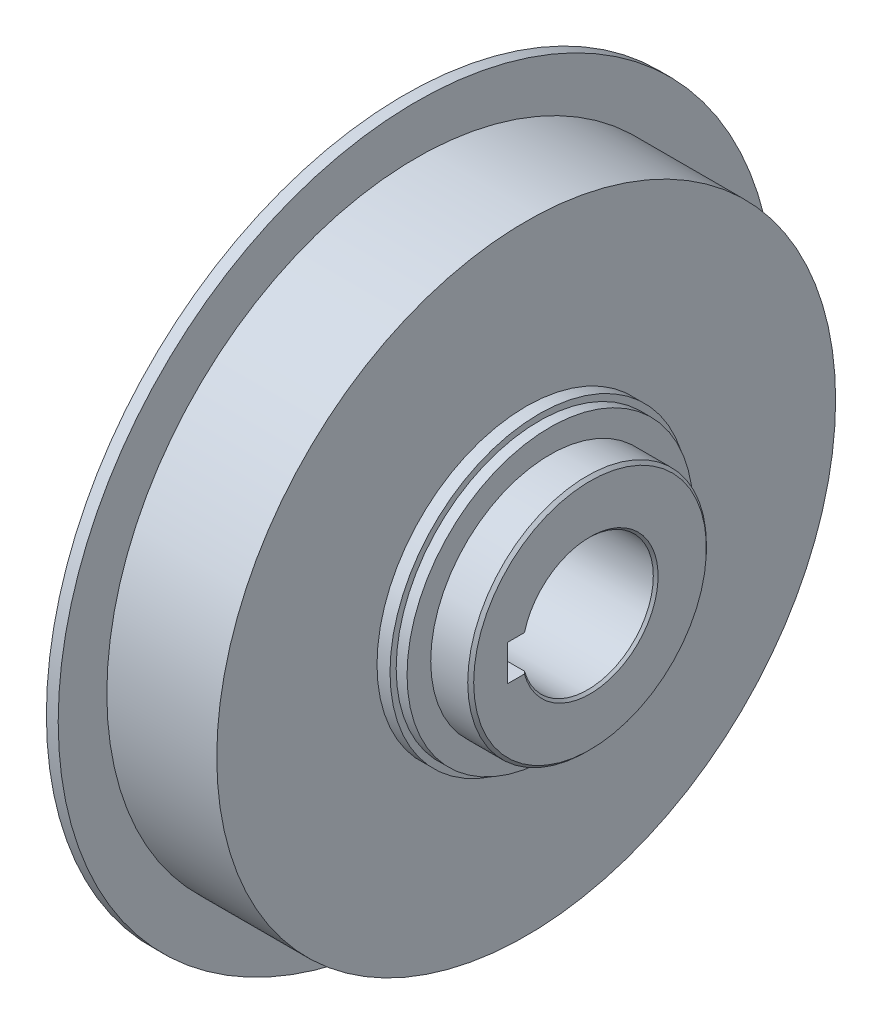
ISO-10303-21;
HEADER;
FILE_DESCRIPTION(('STEP AP214'),'2;1');
FILE_NAME('part.step','',(''),(''),'','','');
FILE_SCHEMA(('AUTOMOTIVE_DESIGN { 1 0 10303 214 1 1 1 1 }'));
ENDSEC;
DATA;
#1=APPLICATION_CONTEXT('core data for automotive mechanical design processes');
#2=APPLICATION_PROTOCOL_DEFINITION('international standard','automotive_design',2000,#1);
#3=PRODUCT_CONTEXT('',#1,'mechanical');
#4=PRODUCT('Part','Part','',(#3));
#5=PRODUCT_RELATED_PRODUCT_CATEGORY('part','',(#4));
#6=PRODUCT_DEFINITION_FORMATION('','',#4);
#7=PRODUCT_DEFINITION_CONTEXT('part definition',#1,'design');
#8=PRODUCT_DEFINITION('design','',#6,#7);
#9=PRODUCT_DEFINITION_SHAPE('','',#8);
#10=(LENGTH_UNIT() NAMED_UNIT(*) SI_UNIT(.MILLI.,.METRE.));
#11=(NAMED_UNIT(*) PLANE_ANGLE_UNIT() SI_UNIT($,.RADIAN.));
#12=(NAMED_UNIT(*) SI_UNIT($,.STERADIAN.) SOLID_ANGLE_UNIT());
#13=UNCERTAINTY_MEASURE_WITH_UNIT(LENGTH_MEASURE(1.E-05),#10,'distance_accuracy_value','');
#14=(GEOMETRIC_REPRESENTATION_CONTEXT(3) GLOBAL_UNCERTAINTY_ASSIGNED_CONTEXT((#13)) GLOBAL_UNIT_ASSIGNED_CONTEXT((#10,
#11,#12)) REPRESENTATION_CONTEXT('',''));
#15=CARTESIAN_POINT('',(0.,0.,0.));
#16=DIRECTION('',(0.,0.,1.));
#17=DIRECTION('',(1.,0.,0.));
#18=AXIS2_PLACEMENT_3D('',#15,#16,#17);
#19=CARTESIAN_POINT('',(75.6,0.,0.));
#20=DIRECTION('',(1.,0.,0.));
#21=DIRECTION('',(0.,0.,-1.));
#22=AXIS2_PLACEMENT_3D('',#19,#20,#21);
#23=CONICAL_SURFACE('',#22,11.4,0.785398163397446);
#24=CARTESIAN_POINT('',(75.2,0.,0.));
#25=DIRECTION('',(-1.,0.,0.));
#26=DIRECTION('',(0.,0.,1.));
#27=AXIS2_PLACEMENT_3D('',#24,#25,#26);
#28=CIRCLE('',#27,11.);
#29=CARTESIAN_POINT('',(75.2,3.,10.5830052442584));
#30=VERTEX_POINT('',#29);
#31=CARTESIAN_POINT('',(75.2,-3.,10.5830052442584));
#32=VERTEX_POINT('',#31);
#33=EDGE_CURVE('E80',#30,#32,#28,.T.);
#34=ORIENTED_EDGE('',*,*,#33,.T.);
#35=CARTESIAN_POINT('',(75.6,-3.,10.998181667894));
#36=CARTESIAN_POINT('',(75.5332855955519,-3.,10.9290315903387));
#37=CARTESIAN_POINT('',(75.4665950600653,-3.,10.8598585163316));
#38=CARTESIAN_POINT('',(75.3332617267318,-3.,10.7214663751199));
#39=CARTESIAN_POINT('',(75.2666189288851,-3.,10.6522473079151));
#40=CARTESIAN_POINT('',(75.2,-3.,10.5830052442584));
#41=B_SPLINE_CURVE_WITH_KNOTS('',3,(#35,#36,#37,#38,#39,#40),.UNSPECIFIED.,.F.,.F.,(4,2,4),(0.,
0.288258348048535,0.576516697322075),.UNSPECIFIED.);
#42=CARTESIAN_POINT('',(75.6,-3.,10.998181667894));
#43=VERTEX_POINT('',#42);
#44=EDGE_CURVE('E75',#43,#32,#41,.T.);
#45=ORIENTED_EDGE('',*,*,#44,.F.);
#46=CARTESIAN_POINT('',(75.6,0.,0.));
#47=DIRECTION('',(1.,0.,0.));
#48=DIRECTION('',(0.,0.,-1.));
#49=AXIS2_PLACEMENT_3D('',#46,#47,#48);
#50=CIRCLE('',#49,11.4);
#51=CARTESIAN_POINT('',(75.6,3.,10.998181667894));
#52=VERTEX_POINT('',#51);
#53=EDGE_CURVE('E73',#52,#43,#50,.F.);
#54=ORIENTED_EDGE('',*,*,#53,.F.);
#55=CARTESIAN_POINT('',(75.2,3.,10.5830052442584));
#56=CARTESIAN_POINT('',(75.2666189288851,3.,10.6522473079151));
#57=CARTESIAN_POINT('',(75.3332617267318,3.,10.7214663751199));
#58=CARTESIAN_POINT('',(75.4665950600653,3.,10.8598585163316));
#59=CARTESIAN_POINT('',(75.5332855955519,3.,10.9290315903387));
#60=CARTESIAN_POINT('',(75.6,3.,10.998181667894));
#61=B_SPLINE_CURVE_WITH_KNOTS('',3,(#55,#56,#57,#58,#59,#60),.UNSPECIFIED.,.F.,.F.,(4,2,4),(0.,
0.288258349273535,0.576516697322084),.UNSPECIFIED.);
#62=EDGE_CURVE('E21',#30,#52,#61,.T.);
#63=ORIENTED_EDGE('',*,*,#62,.F.);
#64=EDGE_LOOP('',(#34,#45,#54,#63));
#65=FACE_BOUND('',#64,.T.);
#66=ADVANCED_FACE('F17',(#65),#23,.F.);
#67=CARTESIAN_POINT('',(56.45,0.,0.));
#68=DIRECTION('',(-1.,0.,0.));
#69=DIRECTION('',(0.,0.,1.));
#70=AXIS2_PLACEMENT_3D('',#67,#68,#69);
#71=CYLINDRICAL_SURFACE('',#70,11.);
#72=ORIENTED_EDGE('',*,*,#33,.F.);
#73=DIRECTION('',(1.,0.,0.));
#74=VECTOR('',#73,1.);
#75=CARTESIAN_POINT('',(56.45,3.,10.5830052442584));
#76=LINE('',#75,#74);
#77=CARTESIAN_POINT('',(37.7,3.,10.5830052442584));
#78=VERTEX_POINT('',#77);
#79=EDGE_CURVE('E88',#78,#30,#76,.T.);
#80=ORIENTED_EDGE('',*,*,#79,.F.);
#81=CARTESIAN_POINT('',(37.7,0.,0.));
#82=DIRECTION('',(-1.,0.,0.));
#83=DIRECTION('',(0.,0.,1.));
#84=AXIS2_PLACEMENT_3D('',#81,#82,#83);
#85=CIRCLE('',#84,11.);
#86=CARTESIAN_POINT('',(37.7,-3.,10.5830052442584));
#87=VERTEX_POINT('',#86);
#88=EDGE_CURVE('E94',#78,#87,#85,.T.);
#89=ORIENTED_EDGE('',*,*,#88,.T.);
#90=DIRECTION('',(1.,0.,0.));
#91=VECTOR('',#90,1.);
#92=CARTESIAN_POINT('',(56.45,-3.,10.5830052442584));
#93=LINE('',#92,#91);
#94=EDGE_CURVE('E79',#32,#87,#93,.F.);
#95=ORIENTED_EDGE('',*,*,#94,.F.);
#96=EDGE_LOOP('',(#72,#80,#89,#95));
#97=FACE_BOUND('',#96,.T.);
#98=ADVANCED_FACE('F309',(#97),#71,.F.);
#99=CARTESIAN_POINT('',(75.6,0.,15.45));
#100=DIRECTION('',(1.,0.,0.));
#101=DIRECTION('',(0.,0.,-1.));
#102=AXIS2_PLACEMENT_3D('',#99,#100,#101);
#103=PLANE('',#102);
#104=DIRECTION('',(0.,0.,-1.));
#105=VECTOR('',#104,1.);
#106=CARTESIAN_POINT('',(75.6,3.,6.9));
#107=LINE('',#106,#105);
#108=CARTESIAN_POINT('',(75.6,3.,13.8));
#109=VERTEX_POINT('',#108);
#110=EDGE_CURVE('E85',#52,#109,#107,.F.);
#111=ORIENTED_EDGE('',*,*,#110,.F.);
#112=ORIENTED_EDGE('',*,*,#53,.T.);
#113=DIRECTION('',(0.,0.,1.));
#114=VECTOR('',#113,1.);
#115=CARTESIAN_POINT('',(75.6,-3.,6.9));
#116=LINE('',#115,#114);
#117=CARTESIAN_POINT('',(75.6,-3.,13.8));
#118=VERTEX_POINT('',#117);
#119=EDGE_CURVE('E110',#118,#43,#116,.F.);
#120=ORIENTED_EDGE('',*,*,#119,.F.);
#121=DIRECTION('',(0.,1.,0.));
#122=VECTOR('',#121,1.);
#123=CARTESIAN_POINT('',(75.6,0.,13.8));
#124=LINE('',#123,#122);
#125=EDGE_CURVE('E92',#118,#109,#124,.T.);
#126=ORIENTED_EDGE('',*,*,#125,.T.);
#127=EDGE_LOOP('',(#111,#112,#120,#126));
#128=FACE_BOUND('',#127,.T.);
#129=CARTESIAN_POINT('',(75.6,0.,0.));
#130=DIRECTION('',(-1.,0.,0.));
#131=DIRECTION('',(0.,0.,1.));
#132=AXIS2_PLACEMENT_3D('',#129,#130,#131);
#133=CIRCLE('',#132,19.5);
#134=CARTESIAN_POINT('',(75.6,0.,19.5));
#135=VERTEX_POINT('',#134);
#136=EDGE_CURVE('E149',#135,#135,#133,.T.);
#137=ORIENTED_EDGE('',*,*,#136,.F.);
#138=EDGE_LOOP('',(#137));
#139=FACE_BOUND('',#138,.T.);
#140=ADVANCED_FACE('F89',(#128,#139),#103,.T.);
#141=CARTESIAN_POINT('',(56.45,-3.,6.9));
#142=DIRECTION('',(0.,1.,0.));
#143=DIRECTION('',(0.,0.,1.));
#144=AXIS2_PLACEMENT_3D('',#141,#142,#143);
#145=PLANE('',#144);
#146=DIRECTION('',(1.,0.,0.));
#147=VECTOR('',#146,1.);
#148=CARTESIAN_POINT('',(56.45,-3.,13.8));
#149=LINE('',#148,#147);
#150=CARTESIAN_POINT('',(37.3,-3.,13.8));
#151=VERTEX_POINT('',#150);
#152=EDGE_CURVE('E386',#151,#118,#149,.T.);
#153=ORIENTED_EDGE('',*,*,#152,.T.);
#154=ORIENTED_EDGE('',*,*,#119,.T.);
#155=ORIENTED_EDGE('',*,*,#44,.T.);
#156=ORIENTED_EDGE('',*,*,#94,.T.);
#157=CARTESIAN_POINT('',(37.7,-3.,10.5830052442584));
#158=CARTESIAN_POINT('',(37.6333810711149,-3.,10.6522473079151));
#159=CARTESIAN_POINT('',(37.5667382732682,-3.,10.7214663751199));
#160=CARTESIAN_POINT('',(37.4334049399347,-3.,10.8598585163316));
#161=CARTESIAN_POINT('',(37.3667144044481,-3.,10.9290315903387));
#162=CARTESIAN_POINT('',(37.3,-3.,10.998181667894));
#163=B_SPLINE_CURVE_WITH_KNOTS('',3,(#157,#158,#159,#160,#161,#162),.UNSPECIFIED.,.F.,.F.,(4,2,
4),(0.,0.288258349273538,0.576516697322079),.UNSPECIFIED.);
#164=CARTESIAN_POINT('',(37.3,-3.,10.998181667894));
#165=VERTEX_POINT('',#164);
#166=EDGE_CURVE('E97',#87,#165,#163,.T.);
#167=ORIENTED_EDGE('',*,*,#166,.T.);
#168=DIRECTION('',(0.,0.,1.));
#169=VECTOR('',#168,1.);
#170=CARTESIAN_POINT('',(37.3,-3.,28.3875));
#171=LINE('',#170,#169);
#172=EDGE_CURVE('E148',#151,#165,#171,.F.);
#173=ORIENTED_EDGE('',*,*,#172,.F.);
#174=EDGE_LOOP('',(#153,#154,#155,#156,#167,#173));
#175=FACE_BOUND('',#174,.T.);
#176=ADVANCED_FACE('F296',(#175),#145,.T.);
#177=CARTESIAN_POINT('',(37.3,0.,0.));
#178=DIRECTION('',(-1.,0.,0.));
#179=DIRECTION('',(0.,0.,1.));
#180=AXIS2_PLACEMENT_3D('',#177,#178,#179);
#181=CONICAL_SURFACE('',#180,11.4,0.78539816339745);
#182=ORIENTED_EDGE('',*,*,#88,.F.);
#183=CARTESIAN_POINT('',(37.3,3.,10.998181667894));
#184=CARTESIAN_POINT('',(37.3667144044481,3.,10.9290315903387));
#185=CARTESIAN_POINT('',(37.4334049399347,3.,10.8598585163316));
#186=CARTESIAN_POINT('',(37.5667382732682,3.,10.7214663751199));
#187=CARTESIAN_POINT('',(37.6333810711149,3.,10.6522473079151));
#188=CARTESIAN_POINT('',(37.7,3.,10.5830052442584));
#189=B_SPLINE_CURVE_WITH_KNOTS('',3,(#183,#184,#185,#186,#187,#188),.UNSPECIFIED.,.F.,.F.,(4,2,
4),(0.,0.288258348048545,0.576516697322085),.UNSPECIFIED.);
#190=CARTESIAN_POINT('',(37.3,3.,10.998181667894));
#191=VERTEX_POINT('',#190);
#192=EDGE_CURVE('E93',#191,#78,#189,.T.);
#193=ORIENTED_EDGE('',*,*,#192,.F.);
#194=CARTESIAN_POINT('',(37.3,0.,0.));
#195=DIRECTION('',(-1.,0.,0.));
#196=DIRECTION('',(0.,0.,1.));
#197=AXIS2_PLACEMENT_3D('',#194,#195,#196);
#198=CIRCLE('',#197,11.4);
#199=EDGE_CURVE('E144',#165,#191,#198,.F.);
#200=ORIENTED_EDGE('',*,*,#199,.F.);
#201=ORIENTED_EDGE('',*,*,#166,.F.);
#202=EDGE_LOOP('',(#182,#193,#200,#201));
#203=FACE_BOUND('',#202,.T.);
#204=ADVANCED_FACE('F161',(#203),#181,.F.);
#205=CARTESIAN_POINT('',(56.45,3.,6.9));
#206=DIRECTION('',(0.,-1.,0.));
#207=DIRECTION('',(0.,0.,-1.));
#208=AXIS2_PLACEMENT_3D('',#205,#206,#207);
#209=PLANE('',#208);
#210=ORIENTED_EDGE('',*,*,#192,.T.);
#211=ORIENTED_EDGE('',*,*,#79,.T.);
#212=ORIENTED_EDGE('',*,*,#62,.T.);
#213=ORIENTED_EDGE('',*,*,#110,.T.);
#214=DIRECTION('',(1.,0.,0.));
#215=VECTOR('',#214,1.);
#216=CARTESIAN_POINT('',(56.45,3.,13.8));
#217=LINE('',#216,#215);
#218=CARTESIAN_POINT('',(37.3,3.,13.8));
#219=VERTEX_POINT('',#218);
#220=EDGE_CURVE('E40',#109,#219,#217,.F.);
#221=ORIENTED_EDGE('',*,*,#220,.T.);
#222=DIRECTION('',(0.,0.,1.));
#223=VECTOR('',#222,1.);
#224=CARTESIAN_POINT('',(37.3,3.,28.3875));
#225=LINE('',#224,#223);
#226=EDGE_CURVE('E147',#191,#219,#225,.T.);
#227=ORIENTED_EDGE('',*,*,#226,.F.);
#228=EDGE_LOOP('',(#210,#211,#212,#213,#221,#227));
#229=FACE_BOUND('',#228,.T.);
#230=ADVANCED_FACE('F84',(#229),#209,.T.);
#231=CARTESIAN_POINT('',(56.45,0.,13.8));
#232=DIRECTION('',(0.,0.,1.));
#233=DIRECTION('',(1.,0.,0.));
#234=AXIS2_PLACEMENT_3D('',#231,#232,#233);
#235=PLANE('',#234);
#236=ORIENTED_EDGE('',*,*,#152,.F.);
#237=DIRECTION('',(0.,1.,0.));
#238=VECTOR('',#237,1.);
#239=CARTESIAN_POINT('',(37.3,0.,13.8));
#240=LINE('',#239,#238);
#241=EDGE_CURVE('E394',#219,#151,#240,.F.);
#242=ORIENTED_EDGE('',*,*,#241,.F.);
#243=ORIENTED_EDGE('',*,*,#220,.F.);
#244=ORIENTED_EDGE('',*,*,#125,.F.);
#245=EDGE_LOOP('',(#236,#242,#243,#244));
#246=FACE_BOUND('',#245,.T.);
#247=ADVANCED_FACE('F166',(#246),#235,.F.);
#248=CARTESIAN_POINT('',(75.1,0.,0.));
#249=DIRECTION('',(-1.,0.,0.));
#250=DIRECTION('',(0.,0.,1.));
#251=AXIS2_PLACEMENT_3D('',#248,#249,#250);
#252=CONICAL_SURFACE('',#251,20.,0.785398163397448);
#253=ORIENTED_EDGE('',*,*,#136,.T.);
#254=EDGE_LOOP('',(#253));
#255=FACE_BOUND('',#254,.T.);
#256=CARTESIAN_POINT('',(75.1,0.,0.));
#257=DIRECTION('',(-1.,0.,0.));
#258=DIRECTION('',(0.,0.,1.));
#259=AXIS2_PLACEMENT_3D('',#256,#257,#258);
#260=CIRCLE('',#259,20.);
#261=CARTESIAN_POINT('',(75.1,0.,20.));
#262=VERTEX_POINT('',#261);
#263=EDGE_CURVE('E143',#262,#262,#260,.T.);
#264=ORIENTED_EDGE('',*,*,#263,.F.);
#265=EDGE_LOOP('',(#264));
#266=FACE_BOUND('',#265,.T.);
#267=ADVANCED_FACE('F170',(#255,#266),#252,.T.);
#268=CARTESIAN_POINT('',(37.3,0.,28.3875));
#269=DIRECTION('',(-1.,0.,0.));
#270=DIRECTION('',(0.,0.,1.));
#271=AXIS2_PLACEMENT_3D('',#268,#269,#270);
#272=PLANE('',#271);
#273=CARTESIAN_POINT('',(37.3,0.,0.));
#274=DIRECTION('',(-1.,0.,0.));
#275=DIRECTION('',(0.,0.,1.));
#276=AXIS2_PLACEMENT_3D('',#273,#274,#275);
#277=CIRCLE('',#276,45.375);
#278=CARTESIAN_POINT('',(37.3,0.,45.375));
#279=VERTEX_POINT('',#278);
#280=EDGE_CURVE('E140',#279,#279,#277,.F.);
#281=ORIENTED_EDGE('',*,*,#280,.F.);
#282=EDGE_LOOP('',(#281));
#283=FACE_BOUND('',#282,.T.);
#284=ORIENTED_EDGE('',*,*,#226,.T.);
#285=ORIENTED_EDGE('',*,*,#241,.T.);
#286=ORIENTED_EDGE('',*,*,#172,.T.);
#287=ORIENTED_EDGE('',*,*,#199,.T.);
#288=EDGE_LOOP('',(#284,#285,#286,#287));
#289=FACE_BOUND('',#288,.T.);
#290=ADVANCED_FACE('F174',(#283,#289),#272,.T.);
#291=CARTESIAN_POINT('',(72.,0.,0.));
#292=DIRECTION('',(-1.,0.,0.));
#293=DIRECTION('',(0.,0.,1.));
#294=AXIS2_PLACEMENT_3D('',#291,#292,#293);
#295=CYLINDRICAL_SURFACE('',#294,20.);
#296=ORIENTED_EDGE('',*,*,#263,.T.);
#297=EDGE_LOOP('',(#296));
#298=FACE_BOUND('',#297,.T.);
#299=CARTESIAN_POINT('',(68.9,0.,0.));
#300=DIRECTION('',(-1.,0.,0.));
#301=DIRECTION('',(0.,0.,1.));
#302=AXIS2_PLACEMENT_3D('',#299,#300,#301);
#303=CIRCLE('',#302,20.);
#304=CARTESIAN_POINT('',(68.9,0.,20.));
#305=VERTEX_POINT('',#304);
#306=EDGE_CURVE('E137',#305,#305,#303,.T.);
#307=ORIENTED_EDGE('',*,*,#306,.F.);
#308=EDGE_LOOP('',(#307));
#309=FACE_BOUND('',#308,.T.);
#310=ADVANCED_FACE('F178',(#298,#309),#295,.T.);
#311=CARTESIAN_POINT('',(40.9,0.,0.));
#312=DIRECTION('',(-1.,0.,0.));
#313=DIRECTION('',(0.,0.,1.));
#314=AXIS2_PLACEMENT_3D('',#311,#312,#313);
#315=CYLINDRICAL_SURFACE('',#314,45.375);
#316=CARTESIAN_POINT('',(44.5,0.,0.));
#317=DIRECTION('',(-1.,0.,0.));
#318=DIRECTION('',(0.,0.,1.));
#319=AXIS2_PLACEMENT_3D('',#316,#317,#318);
#320=CIRCLE('',#319,45.375);
#321=CARTESIAN_POINT('',(44.5,0.,45.375));
#322=VERTEX_POINT('',#321);
#323=EDGE_CURVE('E134',#322,#322,#320,.F.);
#324=ORIENTED_EDGE('',*,*,#323,.F.);
#325=EDGE_LOOP('',(#324));
#326=FACE_BOUND('',#325,.T.);
#327=ORIENTED_EDGE('',*,*,#280,.T.);
#328=EDGE_LOOP('',(#327));
#329=FACE_BOUND('',#328,.T.);
#330=ADVANCED_FACE('F182',(#326,#329),#315,.T.);
#331=CARTESIAN_POINT('',(68.9,0.,21.9825));
#332=DIRECTION('',(1.,0.,0.));
#333=DIRECTION('',(0.,0.,-1.));
#334=AXIS2_PLACEMENT_3D('',#331,#332,#333);
#335=PLANE('',#334);
#336=CARTESIAN_POINT('',(68.9,0.,0.));
#337=DIRECTION('',(-1.,0.,0.));
#338=DIRECTION('',(0.,0.,1.));
#339=AXIS2_PLACEMENT_3D('',#336,#337,#338);
#340=CIRCLE('',#339,23.965);
#341=CARTESIAN_POINT('',(68.9,0.,23.965));
#342=VERTEX_POINT('',#341);
#343=EDGE_CURVE('E131',#342,#342,#340,.T.);
#344=ORIENTED_EDGE('',*,*,#343,.F.);
#345=EDGE_LOOP('',(#344));
#346=FACE_BOUND('',#345,.T.);
#347=ORIENTED_EDGE('',*,*,#306,.T.);
#348=EDGE_LOOP('',(#347));
#349=FACE_BOUND('',#348,.T.);
#350=ADVANCED_FACE('F186',(#346,#349),#335,.T.);
#351=CARTESIAN_POINT('',(44.5,0.,52.6875));
#352=DIRECTION('',(-1.,0.,0.));
#353=DIRECTION('',(0.,0.,1.));
#354=AXIS2_PLACEMENT_3D('',#351,#352,#353);
#355=PLANE('',#354);
#356=ORIENTED_EDGE('',*,*,#323,.T.);
#357=EDGE_LOOP('',(#356));
#358=FACE_BOUND('',#357,.T.);
#359=CARTESIAN_POINT('',(44.5,0.,0.));
#360=DIRECTION('',(-1.,0.,0.));
#361=DIRECTION('',(0.,0.,1.));
#362=AXIS2_PLACEMENT_3D('',#359,#360,#361);
#363=CIRCLE('',#362,60.);
#364=CARTESIAN_POINT('',(44.5,0.,60.));
#365=VERTEX_POINT('',#364);
#366=EDGE_CURVE('E128',#365,#365,#363,.F.);
#367=ORIENTED_EDGE('',*,*,#366,.F.);
#368=EDGE_LOOP('',(#367));
#369=FACE_BOUND('',#368,.T.);
#370=ADVANCED_FACE('F190',(#358,#369),#355,.T.);
#371=CARTESIAN_POINT('',(67.99,0.,0.));
#372=DIRECTION('',(-1.,0.,0.));
#373=DIRECTION('',(0.,0.,1.));
#374=AXIS2_PLACEMENT_3D('',#371,#372,#373);
#375=CYLINDRICAL_SURFACE('',#374,23.965);
#376=ORIENTED_EDGE('',*,*,#343,.T.);
#377=EDGE_LOOP('',(#376));
#378=FACE_BOUND('',#377,.T.);
#379=CARTESIAN_POINT('',(67.08,0.,0.));
#380=DIRECTION('',(-1.,0.,0.));
#381=DIRECTION('',(0.,0.,1.));
#382=AXIS2_PLACEMENT_3D('',#379,#380,#381);
#383=CIRCLE('',#382,23.965);
#384=CARTESIAN_POINT('',(67.08,0.,23.965));
#385=VERTEX_POINT('',#384);
#386=EDGE_CURVE('E125',#385,#385,#383,.T.);
#387=ORIENTED_EDGE('',*,*,#386,.F.);
#388=EDGE_LOOP('',(#387));
#389=FACE_BOUND('',#388,.T.);
#390=ADVANCED_FACE('F194',(#378,#389),#375,.T.);
#391=CARTESIAN_POINT('',(45.49,0.,0.));
#392=DIRECTION('',(-1.,0.,0.));
#393=DIRECTION('',(0.,0.,1.));
#394=AXIS2_PLACEMENT_3D('',#391,#392,#393);
#395=CYLINDRICAL_SURFACE('',#394,60.);
#396=CARTESIAN_POINT('',(46.48,0.,0.));
#397=DIRECTION('',(-1.,0.,0.));
#398=DIRECTION('',(0.,0.,1.));
#399=AXIS2_PLACEMENT_3D('',#396,#397,#398);
#400=CIRCLE('',#399,60.);
#401=CARTESIAN_POINT('',(46.48,0.,60.));
#402=VERTEX_POINT('',#401);
#403=EDGE_CURVE('E122',#402,#402,#400,.F.);
#404=ORIENTED_EDGE('',*,*,#403,.F.);
#405=EDGE_LOOP('',(#404));
#406=FACE_BOUND('',#405,.T.);
#407=ORIENTED_EDGE('',*,*,#366,.T.);
#408=EDGE_LOOP('',(#407));
#409=FACE_BOUND('',#408,.T.);
#410=ADVANCED_FACE('F198',(#406,#409),#395,.T.);
#411=CARTESIAN_POINT('',(67.08,0.,24.4825));
#412=DIRECTION('',(1.,0.,0.));
#413=DIRECTION('',(0.,0.,-1.));
#414=AXIS2_PLACEMENT_3D('',#411,#412,#413);
#415=PLANE('',#414);
#416=CARTESIAN_POINT('',(67.08,0.,0.));
#417=DIRECTION('',(-1.,0.,0.));
#418=DIRECTION('',(0.,0.,1.));
#419=AXIS2_PLACEMENT_3D('',#416,#417,#418);
#420=CIRCLE('',#419,25.);
#421=CARTESIAN_POINT('',(67.08,0.,25.));
#422=VERTEX_POINT('',#421);
#423=EDGE_CURVE('E119',#422,#422,#420,.T.);
#424=ORIENTED_EDGE('',*,*,#423,.F.);
#425=EDGE_LOOP('',(#424));
#426=FACE_BOUND('',#425,.T.);
#427=ORIENTED_EDGE('',*,*,#386,.T.);
#428=EDGE_LOOP('',(#427));
#429=FACE_BOUND('',#428,.T.);
#430=ADVANCED_FACE('F202',(#426,#429),#415,.T.);
#431=CARTESIAN_POINT('',(46.48,0.,55.925));
#432=DIRECTION('',(1.,0.,0.));
#433=DIRECTION('',(0.,0.,-1.));
#434=AXIS2_PLACEMENT_3D('',#431,#432,#433);
#435=PLANE('',#434);
#436=ORIENTED_EDGE('',*,*,#403,.T.);
#437=EDGE_LOOP('',(#436));
#438=FACE_BOUND('',#437,.T.);
#439=CARTESIAN_POINT('',(46.48,0.,0.));
#440=DIRECTION('',(-1.,0.,0.));
#441=DIRECTION('',(0.,0.,1.));
#442=AXIS2_PLACEMENT_3D('',#439,#440,#441);
#443=CIRCLE('',#442,51.85);
#444=CARTESIAN_POINT('',(46.48,0.,51.85));
#445=VERTEX_POINT('',#444);
#446=EDGE_CURVE('E116',#445,#445,#443,.F.);
#447=ORIENTED_EDGE('',*,*,#446,.F.);
#448=EDGE_LOOP('',(#447));
#449=FACE_BOUND('',#448,.T.);
#450=ADVANCED_FACE('F206',(#438,#449),#435,.T.);
#451=CARTESIAN_POINT('',(65.99,0.,0.));
#452=DIRECTION('',(-1.,0.,0.));
#453=DIRECTION('',(0.,0.,1.));
#454=AXIS2_PLACEMENT_3D('',#451,#452,#453);
#455=CYLINDRICAL_SURFACE('',#454,25.);
#456=ORIENTED_EDGE('',*,*,#423,.T.);
#457=EDGE_LOOP('',(#456));
#458=FACE_BOUND('',#457,.T.);
#459=CARTESIAN_POINT('',(64.9,0.,0.));
#460=DIRECTION('',(-1.,0.,0.));
#461=DIRECTION('',(0.,0.,1.));
#462=AXIS2_PLACEMENT_3D('',#459,#460,#461);
#463=CIRCLE('',#462,25.);
#464=CARTESIAN_POINT('',(64.9,0.,25.));
#465=VERTEX_POINT('',#464);
#466=EDGE_CURVE('E31',#465,#465,#463,.T.);
#467=ORIENTED_EDGE('',*,*,#466,.F.);
#468=EDGE_LOOP('',(#467));
#469=FACE_BOUND('',#468,.T.);
#470=ADVANCED_FACE('F210',(#458,#469),#455,.T.);
#471=CARTESIAN_POINT('',(55.69,0.,0.));
#472=DIRECTION('',(-1.,0.,0.));
#473=DIRECTION('',(0.,0.,1.));
#474=AXIS2_PLACEMENT_3D('',#471,#472,#473);
#475=CYLINDRICAL_SURFACE('',#474,51.85);
#476=CARTESIAN_POINT('',(64.9,0.,0.));
#477=DIRECTION('',(-1.,0.,0.));
#478=DIRECTION('',(0.,0.,1.));
#479=AXIS2_PLACEMENT_3D('',#476,#477,#478);
#480=CIRCLE('',#479,51.85);
#481=CARTESIAN_POINT('',(64.9,0.,51.85));
#482=VERTEX_POINT('',#481);
#483=EDGE_CURVE('E11',#482,#482,#480,.F.);
#484=ORIENTED_EDGE('',*,*,#483,.F.);
#485=EDGE_LOOP('',(#484));
#486=FACE_BOUND('',#485,.T.);
#487=ORIENTED_EDGE('',*,*,#446,.T.);
#488=EDGE_LOOP('',(#487));
#489=FACE_BOUND('',#488,.T.);
#490=ADVANCED_FACE('F214',(#486,#489),#475,.T.);
#491=CARTESIAN_POINT('',(64.9,0.,38.425));
#492=DIRECTION('',(1.,0.,0.));
#493=DIRECTION('',(0.,0.,-1.));
#494=AXIS2_PLACEMENT_3D('',#491,#492,#493);
#495=PLANE('',#494);
#496=ORIENTED_EDGE('',*,*,#483,.T.);
#497=EDGE_LOOP('',(#496));
#498=FACE_BOUND('',#497,.T.);
#499=ORIENTED_EDGE('',*,*,#466,.T.);
#500=EDGE_LOOP('',(#499));
#501=FACE_BOUND('',#500,.T.);
#502=ADVANCED_FACE('F218',(#498,#501),#495,.T.);
#503=CLOSED_SHELL('',(#66,#98,#140,#176,#204,#230,#247,#267,#290,#310,#330,#350,#370,#390,#410,
#430,#450,#470,#490,#502));
#504=MANIFOLD_SOLID_BREP('B1',#503);
#505=ADVANCED_BREP_SHAPE_REPRESENTATION('',(#18,#504),#14);
#506=SHAPE_DEFINITION_REPRESENTATION(#9,#505);
ENDSEC;
END-ISO-10303-21;
